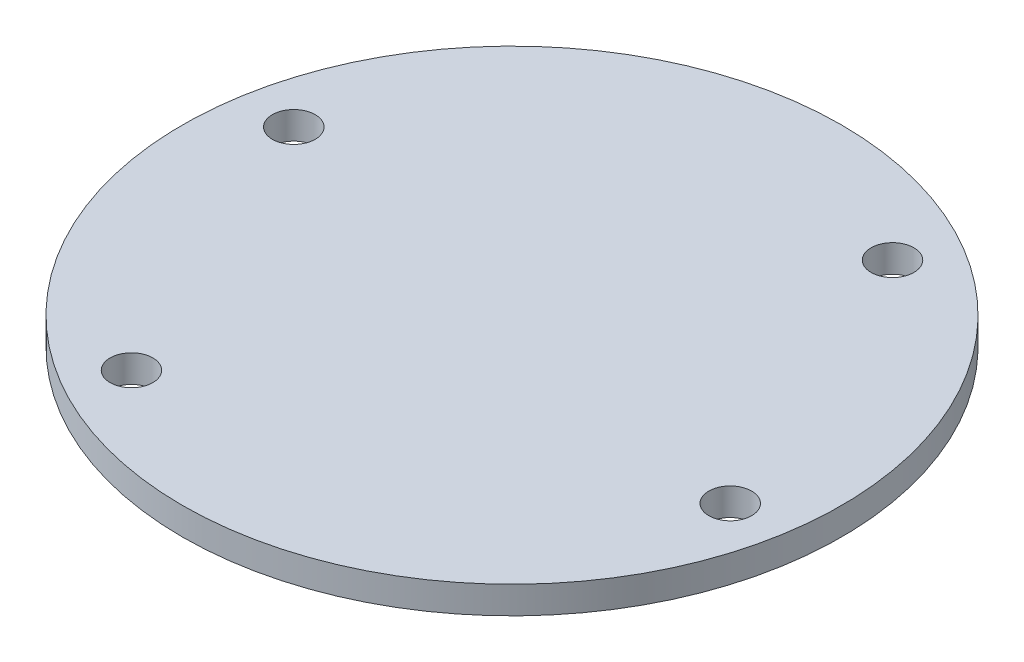
ISO-10303-21;
HEADER;
FILE_DESCRIPTION(('STEP AP214'),'2;1');
FILE_NAME('part.step','',(''),(''),'','','');
FILE_SCHEMA(('AUTOMOTIVE_DESIGN { 1 0 10303 214 1 1 1 1 }'));
ENDSEC;
DATA;
#1=APPLICATION_CONTEXT('core data for automotive mechanical design processes');
#2=APPLICATION_PROTOCOL_DEFINITION('international standard','automotive_design',2000,#1);
#3=PRODUCT_CONTEXT('',#1,'mechanical');
#4=PRODUCT('Part','Part','',(#3));
#5=PRODUCT_RELATED_PRODUCT_CATEGORY('part','',(#4));
#6=PRODUCT_DEFINITION_FORMATION('','',#4);
#7=PRODUCT_DEFINITION_CONTEXT('part definition',#1,'design');
#8=PRODUCT_DEFINITION('design','',#6,#7);
#9=PRODUCT_DEFINITION_SHAPE('','',#8);
#10=(LENGTH_UNIT() NAMED_UNIT(*) SI_UNIT(.MILLI.,.METRE.));
#11=(NAMED_UNIT(*) PLANE_ANGLE_UNIT() SI_UNIT($,.RADIAN.));
#12=(NAMED_UNIT(*) SI_UNIT($,.STERADIAN.) SOLID_ANGLE_UNIT());
#13=UNCERTAINTY_MEASURE_WITH_UNIT(LENGTH_MEASURE(1.E-05),#10,'distance_accuracy_value','');
#14=(GEOMETRIC_REPRESENTATION_CONTEXT(3) GLOBAL_UNCERTAINTY_ASSIGNED_CONTEXT((#13)) GLOBAL_UNIT_ASSIGNED_CONTEXT((#10,
#11,#12)) REPRESENTATION_CONTEXT('',''));
#15=CARTESIAN_POINT('',(0.,0.,0.));
#16=DIRECTION('',(0.,0.,1.));
#17=DIRECTION('',(1.,0.,0.));
#18=AXIS2_PLACEMENT_3D('',#15,#16,#17);
#19=CARTESIAN_POINT('',(0.,1.6,0.));
#20=DIRECTION('',(0.,-1.,0.));
#21=DIRECTION('',(0.,0.,-1.));
#22=AXIS2_PLACEMENT_3D('',#19,#20,#21);
#23=CYLINDRICAL_SURFACE('',#22,19.25);
#24=CARTESIAN_POINT('',(0.,1.6,0.));
#25=DIRECTION('',(0.,1.,0.));
#26=DIRECTION('',(0.,0.,1.));
#27=AXIS2_PLACEMENT_3D('',#24,#25,#26);
#28=CIRCLE('',#27,19.25);
#29=CARTESIAN_POINT('',(0.,1.6,19.25));
#30=VERTEX_POINT('',#29);
#31=EDGE_CURVE('E10',#30,#30,#28,.T.);
#32=ORIENTED_EDGE('',*,*,#31,.F.);
#33=EDGE_LOOP('',(#32));
#34=FACE_BOUND('',#33,.T.);
#35=CARTESIAN_POINT('',(0.,0.,0.));
#36=DIRECTION('',(0.,1.,0.));
#37=DIRECTION('',(0.,0.,1.));
#38=AXIS2_PLACEMENT_3D('',#35,#36,#37);
#39=CIRCLE('',#38,19.25);
#40=CARTESIAN_POINT('',(0.,0.,19.25));
#41=VERTEX_POINT('',#40);
#42=EDGE_CURVE('E48',#41,#41,#39,.T.);
#43=ORIENTED_EDGE('',*,*,#42,.T.);
#44=EDGE_LOOP('',(#43));
#45=FACE_BOUND('',#44,.T.);
#46=ADVANCED_FACE('F45',(#34,#45),#23,.T.);
#47=CARTESIAN_POINT('',(0.,1.6,0.));
#48=DIRECTION('',(0.,1.,0.));
#49=DIRECTION('',(0.,0.,1.));
#50=AXIS2_PLACEMENT_3D('',#47,#48,#49);
#51=PLANE('',#50);
#52=CARTESIAN_POINT('',(-15.8938168230551,1.6,-3.14717520884511));
#53=DIRECTION('',(0.,1.,0.));
#54=DIRECTION('',(0.,0.,1.));
#55=AXIS2_PLACEMENT_3D('',#52,#53,#54);
#56=CIRCLE('',#55,1.25);
#57=CARTESIAN_POINT('',(-15.8938168230551,1.6,-1.89717520884511));
#58=VERTEX_POINT('',#57);
#59=EDGE_CURVE('E75',#58,#58,#56,.T.);
#60=ORIENTED_EDGE('',*,*,#59,.F.);
#61=EDGE_LOOP('',(#60));
#62=FACE_BOUND('',#61,.T.);
#63=CARTESIAN_POINT('',(-8.32779409122009,1.6,13.8997570356358));
#64=DIRECTION('',(0.,1.,0.));
#65=DIRECTION('',(0.,0.,1.));
#66=AXIS2_PLACEMENT_3D('',#63,#64,#65);
#67=CIRCLE('',#66,1.25);
#68=CARTESIAN_POINT('',(-8.32779409122009,1.6,15.1497570356358));
#69=VERTEX_POINT('',#68);
#70=EDGE_CURVE('E69',#69,#69,#67,.T.);
#71=ORIENTED_EDGE('',*,*,#70,.F.);
#72=EDGE_LOOP('',(#71));
#73=FACE_BOUND('',#72,.T.);
#74=CARTESIAN_POINT('',(15.8938151368431,1.6,3.14717683263332));
#75=DIRECTION('',(0.,1.,0.));
#76=DIRECTION('',(0.,0.,1.));
#77=AXIS2_PLACEMENT_3D('',#74,#75,#76);
#78=CIRCLE('',#77,1.25);
#79=CARTESIAN_POINT('',(15.8938151368431,1.6,4.39717683263333));
#80=VERTEX_POINT('',#79);
#81=EDGE_CURVE('E63',#80,#80,#78,.T.);
#82=ORIENTED_EDGE('',*,*,#81,.F.);
#83=EDGE_LOOP('',(#82));
#84=FACE_BOUND('',#83,.T.);
#85=CARTESIAN_POINT('',(8.32707201320981,1.6,-13.8988461199779));
#86=DIRECTION('',(0.,1.,0.));
#87=DIRECTION('',(0.,0.,1.));
#88=AXIS2_PLACEMENT_3D('',#85,#86,#87);
#89=CIRCLE('',#88,1.25);
#90=CARTESIAN_POINT('',(8.32707201320981,1.6,-12.6488461199779));
#91=VERTEX_POINT('',#90);
#92=EDGE_CURVE('E57',#91,#91,#89,.T.);
#93=ORIENTED_EDGE('',*,*,#92,.F.);
#94=EDGE_LOOP('',(#93));
#95=FACE_BOUND('',#94,.T.);
#96=ORIENTED_EDGE('',*,*,#31,.T.);
#97=EDGE_LOOP('',(#96));
#98=FACE_BOUND('',#97,.T.);
#99=ADVANCED_FACE('F91',(#62,#73,#84,#95,#98),#51,.T.);
#100=CARTESIAN_POINT('',(0.,0.,0.));
#101=DIRECTION('',(0.,1.,0.));
#102=DIRECTION('',(0.,0.,1.));
#103=AXIS2_PLACEMENT_3D('',#100,#101,#102);
#104=PLANE('',#103);
#105=CARTESIAN_POINT('',(-15.8938168230551,0.,-3.14717520884511));
#106=DIRECTION('',(0.,1.,0.));
#107=DIRECTION('',(0.,0.,1.));
#108=AXIS2_PLACEMENT_3D('',#105,#106,#107);
#109=CIRCLE('',#108,1.25);
#110=CARTESIAN_POINT('',(-15.8938168230551,0.,-1.89717520884511));
#111=VERTEX_POINT('',#110);
#112=EDGE_CURVE('E55',#111,#111,#109,.T.);
#113=ORIENTED_EDGE('',*,*,#112,.T.);
#114=EDGE_LOOP('',(#113));
#115=FACE_BOUND('',#114,.T.);
#116=CARTESIAN_POINT('',(-8.32779409122009,0.,13.8997570356358));
#117=DIRECTION('',(0.,1.,0.));
#118=DIRECTION('',(0.,0.,1.));
#119=AXIS2_PLACEMENT_3D('',#116,#117,#118);
#120=CIRCLE('',#119,1.25);
#121=CARTESIAN_POINT('',(-8.32779409122009,0.,15.1497570356358));
#122=VERTEX_POINT('',#121);
#123=EDGE_CURVE('E72',#122,#122,#120,.T.);
#124=ORIENTED_EDGE('',*,*,#123,.T.);
#125=EDGE_LOOP('',(#124));
#126=FACE_BOUND('',#125,.T.);
#127=CARTESIAN_POINT('',(15.8938151368431,0.,3.14717683263332));
#128=DIRECTION('',(0.,1.,0.));
#129=DIRECTION('',(0.,0.,1.));
#130=AXIS2_PLACEMENT_3D('',#127,#128,#129);
#131=CIRCLE('',#130,1.25);
#132=CARTESIAN_POINT('',(15.8938151368431,0.,4.39717683263333));
#133=VERTEX_POINT('',#132);
#134=EDGE_CURVE('E66',#133,#133,#131,.T.);
#135=ORIENTED_EDGE('',*,*,#134,.T.);
#136=EDGE_LOOP('',(#135));
#137=FACE_BOUND('',#136,.T.);
#138=CARTESIAN_POINT('',(8.32707201320981,0.,-13.8988461199779));
#139=DIRECTION('',(0.,1.,0.));
#140=DIRECTION('',(0.,0.,1.));
#141=AXIS2_PLACEMENT_3D('',#138,#139,#140);
#142=CIRCLE('',#141,1.25);
#143=CARTESIAN_POINT('',(8.32707201320981,0.,-12.6488461199779));
#144=VERTEX_POINT('',#143);
#145=EDGE_CURVE('E60',#144,#144,#142,.T.);
#146=ORIENTED_EDGE('',*,*,#145,.T.);
#147=EDGE_LOOP('',(#146));
#148=FACE_BOUND('',#147,.T.);
#149=ORIENTED_EDGE('',*,*,#42,.F.);
#150=EDGE_LOOP('',(#149));
#151=FACE_BOUND('',#150,.T.);
#152=ADVANCED_FACE('F81',(#115,#126,#137,#148,#151),#104,.F.);
#153=CARTESIAN_POINT('',(8.32707201320981,0.,-13.8988461199779));
#154=DIRECTION('',(0.,1.,0.));
#155=DIRECTION('',(0.,0.,1.));
#156=AXIS2_PLACEMENT_3D('',#153,#154,#155);
#157=CYLINDRICAL_SURFACE('',#156,1.25);
#158=ORIENTED_EDGE('',*,*,#145,.F.);
#159=EDGE_LOOP('',(#158));
#160=FACE_BOUND('',#159,.T.);
#161=ORIENTED_EDGE('',*,*,#92,.T.);
#162=EDGE_LOOP('',(#161));
#163=FACE_BOUND('',#162,.T.);
#164=ADVANCED_FACE('F101',(#160,#163),#157,.F.);
#165=CARTESIAN_POINT('',(15.8938151368431,0.,3.14717683263332));
#166=DIRECTION('',(0.,1.,0.));
#167=DIRECTION('',(0.,0.,1.));
#168=AXIS2_PLACEMENT_3D('',#165,#166,#167);
#169=CYLINDRICAL_SURFACE('',#168,1.25);
#170=ORIENTED_EDGE('',*,*,#134,.F.);
#171=EDGE_LOOP('',(#170));
#172=FACE_BOUND('',#171,.T.);
#173=ORIENTED_EDGE('',*,*,#81,.T.);
#174=EDGE_LOOP('',(#173));
#175=FACE_BOUND('',#174,.T.);
#176=ADVANCED_FACE('F103',(#172,#175),#169,.F.);
#177=CARTESIAN_POINT('',(-8.32779409122009,0.,13.8997570356358));
#178=DIRECTION('',(0.,1.,0.));
#179=DIRECTION('',(0.,0.,1.));
#180=AXIS2_PLACEMENT_3D('',#177,#178,#179);
#181=CYLINDRICAL_SURFACE('',#180,1.25);
#182=ORIENTED_EDGE('',*,*,#123,.F.);
#183=EDGE_LOOP('',(#182));
#184=FACE_BOUND('',#183,.T.);
#185=ORIENTED_EDGE('',*,*,#70,.T.);
#186=EDGE_LOOP('',(#185));
#187=FACE_BOUND('',#186,.T.);
#188=ADVANCED_FACE('F87',(#184,#187),#181,.F.);
#189=CARTESIAN_POINT('',(-15.8938168230551,0.,-3.14717520884511));
#190=DIRECTION('',(0.,1.,0.));
#191=DIRECTION('',(0.,0.,1.));
#192=AXIS2_PLACEMENT_3D('',#189,#190,#191);
#193=CYLINDRICAL_SURFACE('',#192,1.25);
#194=ORIENTED_EDGE('',*,*,#112,.F.);
#195=EDGE_LOOP('',(#194));
#196=FACE_BOUND('',#195,.T.);
#197=ORIENTED_EDGE('',*,*,#59,.T.);
#198=EDGE_LOOP('',(#197));
#199=FACE_BOUND('',#198,.T.);
#200=ADVANCED_FACE('F84',(#196,#199),#193,.F.);
#201=CLOSED_SHELL('',(#46,#99,#152,#164,#176,#188,#200));
#202=MANIFOLD_SOLID_BREP('B2',#201);
#203=ADVANCED_BREP_SHAPE_REPRESENTATION('',(#18,#202),#14);
#204=SHAPE_DEFINITION_REPRESENTATION(#9,#203);
ENDSEC;
END-ISO-10303-21;
